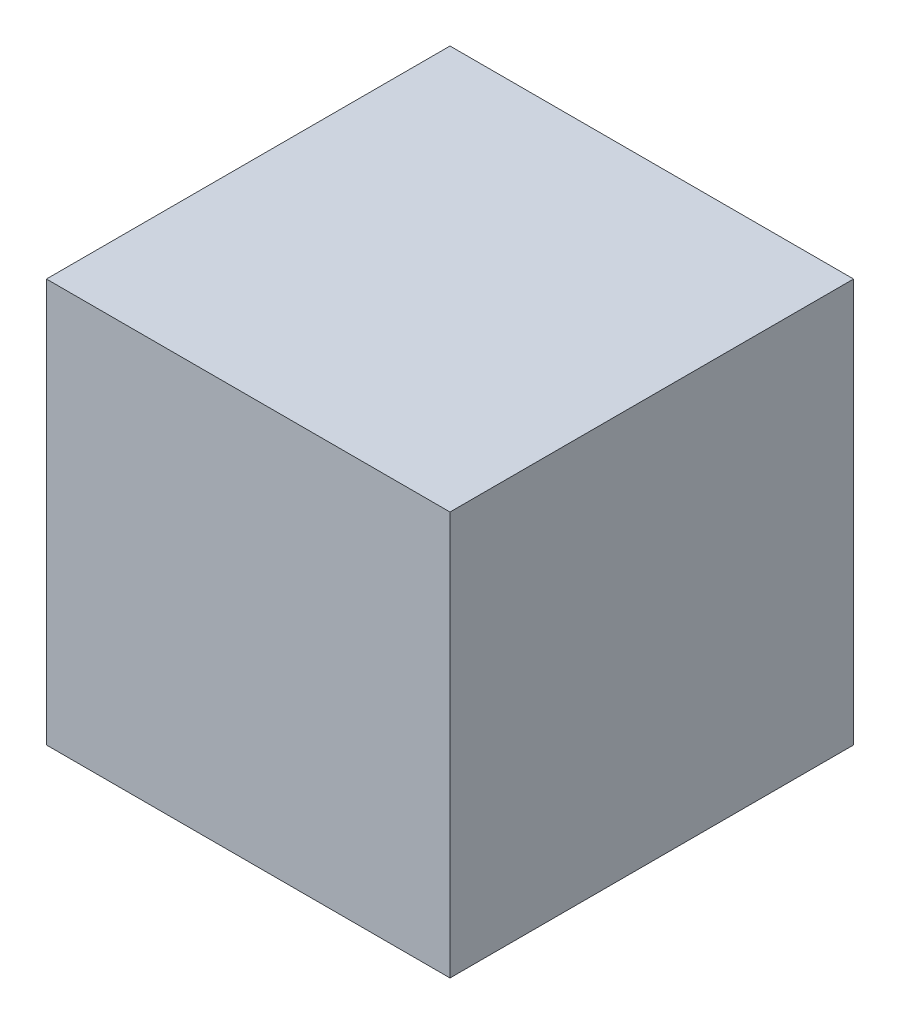
ISO-10303-21;
HEADER;
FILE_DESCRIPTION(('STEP AP214'),'2;1');
FILE_NAME('part.step','',(''),(''),'','','');
FILE_SCHEMA(('AUTOMOTIVE_DESIGN { 1 0 10303 214 1 1 1 1 }'));
ENDSEC;
DATA;
#1=APPLICATION_CONTEXT('core data for automotive mechanical design processes');
#2=APPLICATION_PROTOCOL_DEFINITION('international standard','automotive_design',2000,#1);
#3=PRODUCT_CONTEXT('',#1,'mechanical');
#4=PRODUCT('Part','Part','',(#3));
#5=PRODUCT_RELATED_PRODUCT_CATEGORY('part','',(#4));
#6=PRODUCT_DEFINITION_FORMATION('','',#4);
#7=PRODUCT_DEFINITION_CONTEXT('part definition',#1,'design');
#8=PRODUCT_DEFINITION('design','',#6,#7);
#9=PRODUCT_DEFINITION_SHAPE('','',#8);
#10=(LENGTH_UNIT() NAMED_UNIT(*) SI_UNIT(.MILLI.,.METRE.));
#11=(NAMED_UNIT(*) PLANE_ANGLE_UNIT() SI_UNIT($,.RADIAN.));
#12=(NAMED_UNIT(*) SI_UNIT($,.STERADIAN.) SOLID_ANGLE_UNIT());
#13=UNCERTAINTY_MEASURE_WITH_UNIT(LENGTH_MEASURE(1.E-05),#10,'distance_accuracy_value','');
#14=(GEOMETRIC_REPRESENTATION_CONTEXT(3) GLOBAL_UNCERTAINTY_ASSIGNED_CONTEXT((#13)) GLOBAL_UNIT_ASSIGNED_CONTEXT((#10,
#11,#12)) REPRESENTATION_CONTEXT('',''));
#15=CARTESIAN_POINT('',(0.,0.,0.));
#16=DIRECTION('',(0.,0.,1.));
#17=DIRECTION('',(1.,0.,0.));
#18=AXIS2_PLACEMENT_3D('',#15,#16,#17);
#19=CARTESIAN_POINT('',(0.,914.4,0.));
#20=DIRECTION('',(1.,0.,0.));
#21=DIRECTION('',(0.,0.,-1.));
#22=AXIS2_PLACEMENT_3D('',#19,#20,#21);
#23=PLANE('',#22);
#24=DIRECTION('',(0.,0.,1.));
#25=VECTOR('',#24,1.);
#26=CARTESIAN_POINT('',(0.,0.,0.));
#27=LINE('',#26,#25);
#28=CARTESIAN_POINT('',(0.,0.,0.));
#29=VERTEX_POINT('',#28);
#30=CARTESIAN_POINT('',(1.11981703314034E-13,0.,914.4));
#31=VERTEX_POINT('',#30);
#32=EDGE_CURVE('E96',#29,#31,#27,.T.);
#33=ORIENTED_EDGE('',*,*,#32,.T.);
#34=DIRECTION('',(0.,-1.,0.));
#35=VECTOR('',#34,1.);
#36=CARTESIAN_POINT('',(1.11981703314034E-13,914.4,914.4));
#37=LINE('',#36,#35);
#38=CARTESIAN_POINT('',(1.11981703314034E-13,914.4,914.4));
#39=VERTEX_POINT('',#38);
#40=EDGE_CURVE('E11',#39,#31,#37,.T.);
#41=ORIENTED_EDGE('',*,*,#40,.F.);
#42=DIRECTION('',(0.,0.,1.));
#43=VECTOR('',#42,1.);
#44=CARTESIAN_POINT('',(0.,914.4,0.));
#45=LINE('',#44,#43);
#46=CARTESIAN_POINT('',(0.,914.4,0.));
#47=VERTEX_POINT('',#46);
#48=EDGE_CURVE('E84',#47,#39,#45,.T.);
#49=ORIENTED_EDGE('',*,*,#48,.F.);
#50=DIRECTION('',(0.,-1.,0.));
#51=VECTOR('',#50,1.);
#52=CARTESIAN_POINT('',(0.,914.4,0.));
#53=LINE('',#52,#51);
#54=EDGE_CURVE('E92',#47,#29,#53,.T.);
#55=ORIENTED_EDGE('',*,*,#54,.T.);
#56=EDGE_LOOP('',(#33,#41,#49,#55));
#57=FACE_BOUND('',#56,.T.);
#58=ADVANCED_FACE('F33',(#57),#23,.F.);
#59=CARTESIAN_POINT('',(1.11981703314034E-13,914.4,914.4));
#60=DIRECTION('',(0.,0.,-1.));
#61=DIRECTION('',(-1.,0.,0.));
#62=AXIS2_PLACEMENT_3D('',#59,#60,#61);
#63=PLANE('',#62);
#64=DIRECTION('',(1.,0.,0.));
#65=VECTOR('',#64,1.);
#66=CARTESIAN_POINT('',(1.11981703314034E-13,0.,914.4));
#67=LINE('',#66,#65);
#68=CARTESIAN_POINT('',(914.4,0.,914.4));
#69=VERTEX_POINT('',#68);
#70=EDGE_CURVE('E88',#31,#69,#67,.T.);
#71=ORIENTED_EDGE('',*,*,#70,.T.);
#72=DIRECTION('',(0.,-1.,0.));
#73=VECTOR('',#72,1.);
#74=CARTESIAN_POINT('',(914.4,914.4,914.4));
#75=LINE('',#74,#73);
#76=CARTESIAN_POINT('',(914.4,914.4,914.4));
#77=VERTEX_POINT('',#76);
#78=EDGE_CURVE('E41',#77,#69,#75,.T.);
#79=ORIENTED_EDGE('',*,*,#78,.F.);
#80=DIRECTION('',(1.,0.,0.));
#81=VECTOR('',#80,1.);
#82=CARTESIAN_POINT('',(1.11981703314034E-13,914.4,914.4));
#83=LINE('',#82,#81);
#84=EDGE_CURVE('E79',#39,#77,#83,.T.);
#85=ORIENTED_EDGE('',*,*,#84,.F.);
#86=ORIENTED_EDGE('',*,*,#40,.T.);
#87=EDGE_LOOP('',(#71,#79,#85,#86));
#88=FACE_BOUND('',#87,.T.);
#89=ADVANCED_FACE('F87',(#88),#63,.F.);
#90=CARTESIAN_POINT('',(914.4,914.4,0.));
#91=DIRECTION('',(-1.,0.,0.));
#92=DIRECTION('',(0.,0.,1.));
#93=AXIS2_PLACEMENT_3D('',#90,#91,#92);
#94=PLANE('',#93);
#95=DIRECTION('',(0.,0.,-1.));
#96=VECTOR('',#95,1.);
#97=CARTESIAN_POINT('',(914.4,0.,0.));
#98=LINE('',#97,#96);
#99=CARTESIAN_POINT('',(914.4,0.,0.));
#100=VERTEX_POINT('',#99);
#101=EDGE_CURVE('E66',#69,#100,#98,.T.);
#102=ORIENTED_EDGE('',*,*,#101,.T.);
#103=DIRECTION('',(0.,-1.,0.));
#104=VECTOR('',#103,1.);
#105=CARTESIAN_POINT('',(914.4,914.4,0.));
#106=LINE('',#105,#104);
#107=CARTESIAN_POINT('',(914.4,914.4,0.));
#108=VERTEX_POINT('',#107);
#109=EDGE_CURVE('E89',#108,#100,#106,.T.);
#110=ORIENTED_EDGE('',*,*,#109,.F.);
#111=DIRECTION('',(0.,0.,-1.));
#112=VECTOR('',#111,1.);
#113=CARTESIAN_POINT('',(914.4,914.4,0.));
#114=LINE('',#113,#112);
#115=EDGE_CURVE('E82',#77,#108,#114,.T.);
#116=ORIENTED_EDGE('',*,*,#115,.F.);
#117=ORIENTED_EDGE('',*,*,#78,.T.);
#118=EDGE_LOOP('',(#102,#110,#116,#117));
#119=FACE_BOUND('',#118,.T.);
#120=ADVANCED_FACE('F90',(#119),#94,.F.);
#121=CARTESIAN_POINT('',(0.,914.4,0.));
#122=DIRECTION('',(0.,0.,1.));
#123=DIRECTION('',(1.,0.,0.));
#124=AXIS2_PLACEMENT_3D('',#121,#122,#123);
#125=PLANE('',#124);
#126=DIRECTION('',(-1.,0.,0.));
#127=VECTOR('',#126,1.);
#128=CARTESIAN_POINT('',(0.,0.,0.));
#129=LINE('',#128,#127);
#130=EDGE_CURVE('E72',#100,#29,#129,.T.);
#131=ORIENTED_EDGE('',*,*,#130,.T.);
#132=ORIENTED_EDGE('',*,*,#54,.F.);
#133=DIRECTION('',(-1.,0.,0.));
#134=VECTOR('',#133,1.);
#135=CARTESIAN_POINT('',(0.,914.4,0.));
#136=LINE('',#135,#134);
#137=EDGE_CURVE('E49',#108,#47,#136,.T.);
#138=ORIENTED_EDGE('',*,*,#137,.F.);
#139=ORIENTED_EDGE('',*,*,#109,.T.);
#140=EDGE_LOOP('',(#131,#132,#138,#139));
#141=FACE_BOUND('',#140,.T.);
#142=ADVANCED_FACE('F103',(#141),#125,.F.);
#143=CARTESIAN_POINT('',(0.,914.4,0.));
#144=DIRECTION('',(0.,1.,0.));
#145=DIRECTION('',(0.,0.,1.));
#146=AXIS2_PLACEMENT_3D('',#143,#144,#145);
#147=PLANE('',#146);
#148=ORIENTED_EDGE('',*,*,#48,.T.);
#149=ORIENTED_EDGE('',*,*,#84,.T.);
#150=ORIENTED_EDGE('',*,*,#115,.T.);
#151=ORIENTED_EDGE('',*,*,#137,.T.);
#152=EDGE_LOOP('',(#148,#149,#150,#151));
#153=FACE_BOUND('',#152,.T.);
#154=ADVANCED_FACE('F80',(#153),#147,.T.);
#155=CARTESIAN_POINT('',(0.,0.,0.));
#156=DIRECTION('',(0.,1.,0.));
#157=DIRECTION('',(0.,0.,1.));
#158=AXIS2_PLACEMENT_3D('',#155,#156,#157);
#159=PLANE('',#158);
#160=ORIENTED_EDGE('',*,*,#32,.F.);
#161=ORIENTED_EDGE('',*,*,#130,.F.);
#162=ORIENTED_EDGE('',*,*,#101,.F.);
#163=ORIENTED_EDGE('',*,*,#70,.F.);
#164=EDGE_LOOP('',(#160,#161,#162,#163));
#165=FACE_BOUND('',#164,.T.);
#166=ADVANCED_FACE('F106',(#165),#159,.F.);
#167=CLOSED_SHELL('',(#58,#89,#120,#142,#154,#166));
#168=MANIFOLD_SOLID_BREP('B2',#167);
#169=ADVANCED_BREP_SHAPE_REPRESENTATION('',(#18,#168),#14);
#170=SHAPE_DEFINITION_REPRESENTATION(#9,#169);
ENDSEC;
END-ISO-10303-21;
